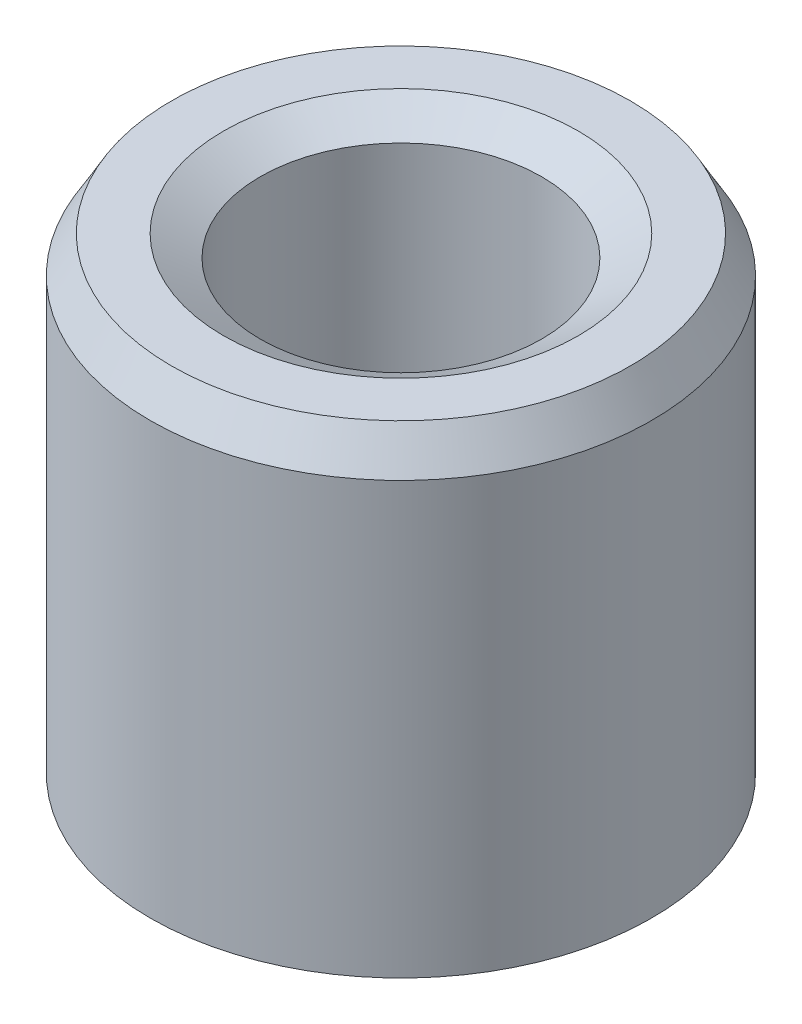
ISO-10303-21;
HEADER;
FILE_DESCRIPTION(('STEP AP214'),'2;1');
FILE_NAME('part.step','',(''),(''),'','','');
FILE_SCHEMA(('AUTOMOTIVE_DESIGN { 1 0 10303 214 1 1 1 1 }'));
ENDSEC;
DATA;
#1=APPLICATION_CONTEXT('core data for automotive mechanical design processes');
#2=APPLICATION_PROTOCOL_DEFINITION('international standard','automotive_design',2000,#1);
#3=PRODUCT_CONTEXT('',#1,'mechanical');
#4=PRODUCT('Part','Part','',(#3));
#5=PRODUCT_RELATED_PRODUCT_CATEGORY('part','',(#4));
#6=PRODUCT_DEFINITION_FORMATION('','',#4);
#7=PRODUCT_DEFINITION_CONTEXT('part definition',#1,'design');
#8=PRODUCT_DEFINITION('design','',#6,#7);
#9=PRODUCT_DEFINITION_SHAPE('','',#8);
#10=(LENGTH_UNIT() NAMED_UNIT(*) SI_UNIT(.MILLI.,.METRE.));
#11=(NAMED_UNIT(*) PLANE_ANGLE_UNIT() SI_UNIT($,.RADIAN.));
#12=(NAMED_UNIT(*) SI_UNIT($,.STERADIAN.) SOLID_ANGLE_UNIT());
#13=UNCERTAINTY_MEASURE_WITH_UNIT(LENGTH_MEASURE(1.E-05),#10,'distance_accuracy_value','');
#14=(GEOMETRIC_REPRESENTATION_CONTEXT(3) GLOBAL_UNCERTAINTY_ASSIGNED_CONTEXT((#13)) GLOBAL_UNIT_ASSIGNED_CONTEXT((#10,
#11,#12)) REPRESENTATION_CONTEXT('',''));
#15=CARTESIAN_POINT('',(0.,0.,0.));
#16=DIRECTION('',(0.,0.,1.));
#17=DIRECTION('',(1.,0.,0.));
#18=AXIS2_PLACEMENT_3D('',#15,#16,#17);
#19=CARTESIAN_POINT('',(0.,9.7467978960001,0.));
#20=DIRECTION('',(0.,-1.,0.));
#21=DIRECTION('',(0.,0.,-1.));
#22=AXIS2_PLACEMENT_3D('',#19,#20,#21);
#23=CYLINDRICAL_SURFACE('',#22,5.);
#24=CARTESIAN_POINT('',(0.,0.423034800195923,0.));
#25=DIRECTION('',(0.,1.,0.));
#26=DIRECTION('',(0.,0.,1.));
#27=AXIS2_PLACEMENT_3D('',#24,#25,#26);
#28=CIRCLE('',#27,5.);
#29=CARTESIAN_POINT('',(0.,0.423034800195923,5.));
#30=VERTEX_POINT('',#29);
#31=EDGE_CURVE('E10',#30,#30,#28,.T.);
#32=ORIENTED_EDGE('',*,*,#31,.T.);
#33=EDGE_LOOP('',(#32));
#34=FACE_BOUND('',#33,.T.);
#35=CARTESIAN_POINT('',(0.,9.01573868745296,0.));
#36=DIRECTION('',(0.,1.,0.));
#37=DIRECTION('',(0.,0.,1.));
#38=AXIS2_PLACEMENT_3D('',#35,#36,#37);
#39=CIRCLE('',#38,5.);
#40=CARTESIAN_POINT('',(0.,9.01573868745296,5.));
#41=VERTEX_POINT('',#40);
#42=EDGE_CURVE('E50',#41,#41,#39,.F.);
#43=ORIENTED_EDGE('',*,*,#42,.T.);
#44=EDGE_LOOP('',(#43));
#45=FACE_BOUND('',#44,.T.);
#46=ADVANCED_FACE('F39',(#34,#45),#23,.T.);
#47=CARTESIAN_POINT('',(0.,9.7467978960001,0.));
#48=DIRECTION('',(0.,1.,0.));
#49=DIRECTION('',(0.,0.,1.));
#50=AXIS2_PLACEMENT_3D('',#47,#48,#49);
#51=PLANE('',#50);
#52=CARTESIAN_POINT('',(0.,9.7467978960001,0.));
#53=DIRECTION('',(0.,1.,0.));
#54=DIRECTION('',(0.,0.,1.));
#55=AXIS2_PLACEMENT_3D('',#52,#53,#54);
#56=CIRCLE('',#55,3.53675257882036);
#57=CARTESIAN_POINT('',(0.,9.7467978960001,3.53675257882036));
#58=VERTEX_POINT('',#57);
#59=EDGE_CURVE('E58',#58,#58,#56,.F.);
#60=ORIENTED_EDGE('',*,*,#59,.T.);
#61=EDGE_LOOP('',(#60));
#62=FACE_BOUND('',#61,.T.);
#63=CARTESIAN_POINT('',(0.,9.7467978960001,0.));
#64=DIRECTION('',(0.,1.,0.));
#65=DIRECTION('',(0.,0.,1.));
#66=AXIS2_PLACEMENT_3D('',#63,#64,#65);
#67=CIRCLE('',#66,4.57696519980407);
#68=CARTESIAN_POINT('',(0.,9.7467978960001,4.57696519980407));
#69=VERTEX_POINT('',#68);
#70=EDGE_CURVE('E61',#69,#69,#67,.T.);
#71=ORIENTED_EDGE('',*,*,#70,.T.);
#72=EDGE_LOOP('',(#71));
#73=FACE_BOUND('',#72,.T.);
#74=ADVANCED_FACE('F88',(#62,#73),#51,.T.);
#75=CARTESIAN_POINT('',(0.,0.,0.));
#76=DIRECTION('',(0.,1.,0.));
#77=DIRECTION('',(0.,0.,1.));
#78=AXIS2_PLACEMENT_3D('',#75,#76,#77);
#79=PLANE('',#78);
#80=CARTESIAN_POINT('',(0.,0.,0.));
#81=DIRECTION('',(0.,1.,0.));
#82=DIRECTION('',(0.,0.,1.));
#83=AXIS2_PLACEMENT_3D('',#80,#81,#82);
#84=CIRCLE('',#83,3.22872817046916);
#85=CARTESIAN_POINT('',(0.,0.,-3.22872817046916));
#86=VERTEX_POINT('',#85);
#87=EDGE_CURVE('E51',#86,#86,#84,.T.);
#88=ORIENTED_EDGE('',*,*,#87,.T.);
#89=EDGE_LOOP('',(#88));
#90=FACE_BOUND('',#89,.T.);
#91=CARTESIAN_POINT('',(0.,0.,0.));
#92=DIRECTION('',(0.,1.,0.));
#93=DIRECTION('',(0.,0.,1.));
#94=AXIS2_PLACEMENT_3D('',#91,#92,#93);
#95=CIRCLE('',#94,4.26894079145287);
#96=CARTESIAN_POINT('',(0.,0.,4.26894079145287));
#97=VERTEX_POINT('',#96);
#98=EDGE_CURVE('E54',#97,#97,#95,.F.);
#99=ORIENTED_EDGE('',*,*,#98,.T.);
#100=EDGE_LOOP('',(#99));
#101=FACE_BOUND('',#100,.T.);
#102=ADVANCED_FACE('F83',(#90,#101),#79,.F.);
#103=CARTESIAN_POINT('',(0.,9.7467978960001,0.));
#104=DIRECTION('',(0.,-1.,0.));
#105=DIRECTION('',(0.,0.,-1.));
#106=AXIS2_PLACEMENT_3D('',#103,#104,#105);
#107=CYLINDRICAL_SURFACE('',#106,2.80569337027323);
#108=CARTESIAN_POINT('',(0.,9.32376309580417,0.));
#109=DIRECTION('',(0.,1.,0.));
#110=DIRECTION('',(0.,0.,1.));
#111=AXIS2_PLACEMENT_3D('',#108,#109,#110);
#112=CIRCLE('',#111,2.80569337027323);
#113=CARTESIAN_POINT('',(0.,9.32376309580417,2.80569337027323));
#114=VERTEX_POINT('',#113);
#115=EDGE_CURVE('E67',#114,#114,#112,.T.);
#116=ORIENTED_EDGE('',*,*,#115,.T.);
#117=EDGE_LOOP('',(#116));
#118=FACE_BOUND('',#117,.T.);
#119=CARTESIAN_POINT('',(0.,0.731059208547134,0.));
#120=DIRECTION('',(0.,1.,0.));
#121=DIRECTION('',(0.,0.,1.));
#122=AXIS2_PLACEMENT_3D('',#119,#120,#121);
#123=CIRCLE('',#122,2.80569337027323);
#124=CARTESIAN_POINT('',(0.,0.731059208547133,-2.80569337027323));
#125=VERTEX_POINT('',#124);
#126=EDGE_CURVE('E69',#125,#125,#123,.F.);
#127=ORIENTED_EDGE('',*,*,#126,.T.);
#128=EDGE_LOOP('',(#127));
#129=FACE_BOUND('',#128,.T.);
#130=ADVANCED_FACE('F71',(#118,#129),#107,.F.);
#131=CARTESIAN_POINT('',(0.,9.32376309580417,0.));
#132=DIRECTION('',(0.,1.,0.));
#133=DIRECTION('',(0.,0.,1.));
#134=AXIS2_PLACEMENT_3D('',#131,#132,#133);
#135=CONICAL_SURFACE('',#134,2.80569337027323,1.0462157296568);
#136=ORIENTED_EDGE('',*,*,#59,.F.);
#137=EDGE_LOOP('',(#136));
#138=FACE_BOUND('',#137,.T.);
#139=ORIENTED_EDGE('',*,*,#115,.F.);
#140=EDGE_LOOP('',(#139));
#141=FACE_BOUND('',#140,.T.);
#142=ADVANCED_FACE('F77',(#138,#141),#135,.F.);
#143=CARTESIAN_POINT('',(0.,0.,0.));
#144=DIRECTION('',(0.,-1.,0.));
#145=DIRECTION('',(0.,0.,-1.));
#146=AXIS2_PLACEMENT_3D('',#143,#144,#145);
#147=CONICAL_SURFACE('',#146,3.22872817046916,0.524580597138092);
#148=CARTESIAN_POINT('',(0.,0.731059208547133,-2.80569337027323));
#149=CARTESIAN_POINT('',(0.,0.723444008458101,-2.81009998277527));
#150=CARTESIAN_POINT('',(0.,0.715828808369068,-2.81450659527732));
#151=CARTESIAN_POINT('',(0.,0.700598408191003,-2.8233198202814));
#152=CARTESIAN_POINT('',(0.,0.69298320810197,-2.82772643278344));
#153=CARTESIAN_POINT('',(0.,0.677752807923905,-2.83653965778752));
#154=CARTESIAN_POINT('',(0.,0.670137607834872,-2.84094627028956));
#155=CARTESIAN_POINT('',(0.,0.654907207656807,-2.84975949529364));
#156=CARTESIAN_POINT('',(0.,0.647292007567774,-2.85416610779568));
#157=CARTESIAN_POINT('',(0.,0.632061607389709,-2.86297933279977));
#158=CARTESIAN_POINT('',(0.,0.624446407300677,-2.86738594530181));
#159=CARTESIAN_POINT('',(0.,0.609216007122611,-2.87619917030589));
#160=CARTESIAN_POINT('',(0.,0.601600807033579,-2.88060578280793));
#161=CARTESIAN_POINT('',(0.,0.586370406855513,-2.88941900781201));
#162=CARTESIAN_POINT('',(0.,0.578755206766481,-2.89382562031405));
#163=CARTESIAN_POINT('',(0.,0.563524806588415,-2.90263884531813));
#164=CARTESIAN_POINT('',(0.,0.555909606499383,-2.90704545782017));
#165=CARTESIAN_POINT('',(0.,0.540679206321317,-2.91585868282426));
#166=CARTESIAN_POINT('',(0.,0.533064006232285,-2.9202652953263));
#167=CARTESIAN_POINT('',(0.,0.517833606054219,-2.92907852033038));
#168=CARTESIAN_POINT('',(0.,0.510218405965187,-2.93348513283242));
#169=CARTESIAN_POINT('',(0.,0.494988005787122,-2.9422983578365));
#170=CARTESIAN_POINT('',(0.,0.487372805698089,-2.94670497033854));
#171=CARTESIAN_POINT('',(0.,0.472142405520024,-2.95551819534262));
#172=CARTESIAN_POINT('',(0.,0.464527205430991,-2.95992480784466));
#173=CARTESIAN_POINT('',(0.,0.449296805252926,-2.96873803284875));
#174=CARTESIAN_POINT('',(0.,0.441681605163893,-2.97314464535079));
#175=CARTESIAN_POINT('',(0.,0.426451204985828,-2.98195787035487));
#176=CARTESIAN_POINT('',(0.,0.418836004896795,-2.98636448285691));
#177=CARTESIAN_POINT('',(0.,0.40360560471873,-2.99517770786099));
#178=CARTESIAN_POINT('',(0.,0.395990404629697,-2.99958432036303));
#179=CARTESIAN_POINT('',(0.,0.380760004451632,-3.00839754536712));
#180=CARTESIAN_POINT('',(0.,0.373144804362599,-3.01280415786916));
#181=CARTESIAN_POINT('',(0.,0.357914404184534,-3.02161738287324));
#182=CARTESIAN_POINT('',(0.,0.350299204095501,-3.02602399537528));
#183=CARTESIAN_POINT('',(0.,0.335068803917436,-3.03483722037936));
#184=CARTESIAN_POINT('',(0.,0.327453603828403,-3.0392438328814));
#185=CARTESIAN_POINT('',(0.,0.312223203650338,-3.04805705788548));
#186=CARTESIAN_POINT('',(0.,0.304608003561306,-3.05246367038752));
#187=CARTESIAN_POINT('',(0.,0.28937760338324,-3.06127689539161));
#188=CARTESIAN_POINT('',(0.,0.281762403294208,-3.06568350789365));
#189=CARTESIAN_POINT('',(0.,0.266532003116142,-3.07449673289773));
#190=CARTESIAN_POINT('',(0.,0.25891680302711,-3.07890334539977));
#191=CARTESIAN_POINT('',(0.,0.243686402849044,-3.08771657040385));
#192=CARTESIAN_POINT('',(0.,0.236071202760012,-3.09212318290589));
#193=CARTESIAN_POINT('',(0.,0.220840802581947,-3.10093640790997));
#194=CARTESIAN_POINT('',(0.,0.213225602492914,-3.10534302041201));
#195=CARTESIAN_POINT('',(0.,0.197995202314849,-3.1141562454161));
#196=CARTESIAN_POINT('',(0.,0.190380002225816,-3.11856285791814));
#197=CARTESIAN_POINT('',(0.,0.175149602047751,-3.12737608292222));
#198=CARTESIAN_POINT('',(0.,0.167534401958718,-3.13178269542426));
#199=CARTESIAN_POINT('',(0.,0.152304001780653,-3.14059592042834));
#200=CARTESIAN_POINT('',(0.,0.14468880169162,-3.14500253293038));
#201=CARTESIAN_POINT('',(0.,0.129458401513555,-3.15381575793446));
#202=CARTESIAN_POINT('',(0.,0.121843201424522,-3.15822237043651));
#203=CARTESIAN_POINT('',(0.,0.106612801246457,-3.16703559544059));
#204=CARTESIAN_POINT('',(0.,0.0989976011574243,-3.17144220794263));
#205=CARTESIAN_POINT('',(0.,0.0837672009793591,-3.18025543294671));
#206=CARTESIAN_POINT('',(0.,0.0761520008903264,-3.18466204544875));
#207=CARTESIAN_POINT('',(0.,0.0609216007122611,-3.19347527045283));
#208=CARTESIAN_POINT('',(0.,0.0533064006232285,-3.19788188295487));
#209=CARTESIAN_POINT('',(0.,0.0380760004451632,-3.20669510795896));
#210=CARTESIAN_POINT('',(0.,0.0304608003561306,-3.211101720461));
#211=CARTESIAN_POINT('',(0.,0.0152304001780653,-3.21991494546508));
#212=CARTESIAN_POINT('',(0.,0.00761520008903263,-3.22432155796712));
#213=CARTESIAN_POINT('',(0.,0.,-3.22872817046916));
#214=B_SPLINE_CURVE_WITH_KNOTS('',3,(#148,#149,#150,#151,#152,#153,#154,#155,#156,#157,#158,
#159,#160,#161,#162,#163,#164,#165,#166,#167,#168,#169,#170,#171,#172,#173,#174,#175,#176,#177,
#178,#179,#180,#181,#182,#183,#184,#185,#186,#187,#188,#189,#190,#191,#192,#193,#194,#195,#196,
#197,#198,#199,#200,#201,#202,#203,#204,#205,#206,#207,#208,#209,#210,#211,#212,#213),
.UNSPECIFIED.,.F.,.F.,(4,2,2,2,2,2,2,2,2,2,2,2,2,2,2,2,2,2,2,2,2,2,2,2,2,2,2,2,2,2,2,2,4),(0.,
0.0263948016710168,0.0527896033420337,0.0791844050130505,0.105579206684067,0.131974008355084,
0.158368810026101,0.184763611697118,0.211158413368135,0.237553215039152,0.263948016710168,
0.290342818381185,0.316737620052202,0.343132421723219,0.369527223394236,0.395922025065253,
0.422316826736269,0.448711628407286,0.475106430078303,0.50150123174932,0.527896033420337,
0.554290835091354,0.58068563676237,0.607080438433387,0.633475240104404,0.659870041775421,
0.686264843446437,0.712659645117454,0.739054446788471,0.765449248459488,0.791844050130505,
0.818238851801521,0.844633653472538),.UNSPECIFIED.);
#215=EDGE_CURVE('BSEAM73',#125,#86,#214,.T.);
#216=ORIENTED_EDGE('',*,*,#126,.F.);
#217=ORIENTED_EDGE('',*,*,#87,.F.);
#218=ORIENTED_EDGE('',*,*,#215,.T.);
#219=ORIENTED_EDGE('',*,*,#215,.F.);
#220=EDGE_LOOP('',(#216,#218,#217,#219));
#221=FACE_BOUND('',#220,.T.);
#222=ADVANCED_FACE('F73',(#221),#147,.F.);
#223=CARTESIAN_POINT('',(0.,0.423034800195923,0.));
#224=DIRECTION('',(0.,1.,0.));
#225=DIRECTION('',(0.,0.,1.));
#226=AXIS2_PLACEMENT_3D('',#223,#224,#225);
#227=CONICAL_SURFACE('',#226,5.,1.04621572965681);
#228=ORIENTED_EDGE('',*,*,#98,.F.);
#229=EDGE_LOOP('',(#228));
#230=FACE_BOUND('',#229,.T.);
#231=ORIENTED_EDGE('',*,*,#31,.F.);
#232=EDGE_LOOP('',(#231));
#233=FACE_BOUND('',#232,.T.);
#234=ADVANCED_FACE('F76',(#230,#233),#227,.T.);
#235=CARTESIAN_POINT('',(0.,9.7467978960001,0.));
#236=DIRECTION('',(0.,-1.,0.));
#237=DIRECTION('',(0.,0.,-1.));
#238=AXIS2_PLACEMENT_3D('',#235,#236,#237);
#239=CONICAL_SURFACE('',#238,4.57696519980407,0.524580597138093);
#240=ORIENTED_EDGE('',*,*,#42,.F.);
#241=EDGE_LOOP('',(#240));
#242=FACE_BOUND('',#241,.T.);
#243=ORIENTED_EDGE('',*,*,#70,.F.);
#244=EDGE_LOOP('',(#243));
#245=FACE_BOUND('',#244,.T.);
#246=ADVANCED_FACE('F45',(#242,#245),#239,.T.);
#247=CLOSED_SHELL('',(#46,#74,#102,#130,#142,#222,#234,#246));
#248=MANIFOLD_SOLID_BREP('B2',#247);
#249=ADVANCED_BREP_SHAPE_REPRESENTATION('',(#18,#248),#14);
#250=SHAPE_DEFINITION_REPRESENTATION(#9,#249);
ENDSEC;
END-ISO-10303-21;
